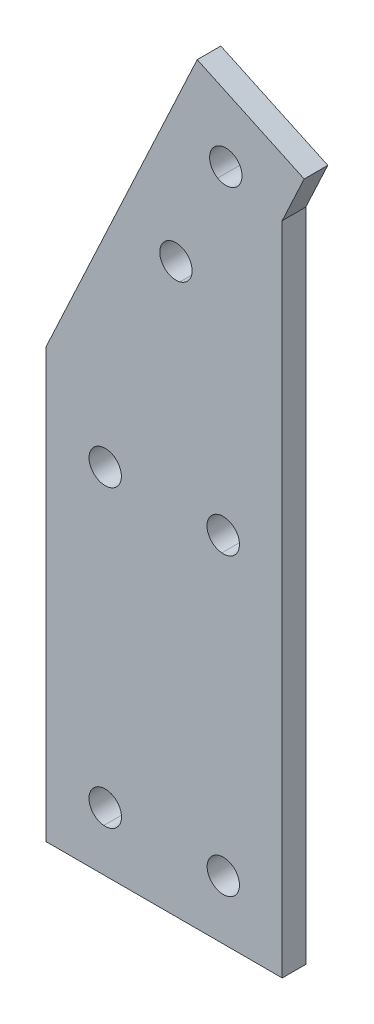
ISO-10303-21;
HEADER;
FILE_DESCRIPTION(('STEP AP214'),'2;1');
FILE_NAME('part.step','',(''),(''),'','','');
FILE_SCHEMA(('AUTOMOTIVE_DESIGN { 1 0 10303 214 1 1 1 1 }'));
ENDSEC;
DATA;
#1=APPLICATION_CONTEXT('core data for automotive mechanical design processes');
#2=APPLICATION_PROTOCOL_DEFINITION('international standard','automotive_design',2000,#1);
#3=PRODUCT_CONTEXT('',#1,'mechanical');
#4=PRODUCT('Part','Part','',(#3));
#5=PRODUCT_RELATED_PRODUCT_CATEGORY('part','',(#4));
#6=PRODUCT_DEFINITION_FORMATION('','',#4);
#7=PRODUCT_DEFINITION_CONTEXT('part definition',#1,'design');
#8=PRODUCT_DEFINITION('design','',#6,#7);
#9=PRODUCT_DEFINITION_SHAPE('','',#8);
#10=(LENGTH_UNIT() NAMED_UNIT(*) SI_UNIT(.MILLI.,.METRE.));
#11=(NAMED_UNIT(*) PLANE_ANGLE_UNIT() SI_UNIT($,.RADIAN.));
#12=(NAMED_UNIT(*) SI_UNIT($,.STERADIAN.) SOLID_ANGLE_UNIT());
#13=UNCERTAINTY_MEASURE_WITH_UNIT(LENGTH_MEASURE(1.E-05),#10,'distance_accuracy_value','');
#14=(GEOMETRIC_REPRESENTATION_CONTEXT(3) GLOBAL_UNCERTAINTY_ASSIGNED_CONTEXT((#13)) GLOBAL_UNIT_ASSIGNED_CONTEXT((#10,
#11,#12)) REPRESENTATION_CONTEXT('',''));
#15=CARTESIAN_POINT('',(0.,0.,0.));
#16=DIRECTION('',(0.,0.,1.));
#17=DIRECTION('',(1.,0.,0.));
#18=AXIS2_PLACEMENT_3D('',#15,#16,#17);
#19=CARTESIAN_POINT('',(-252.534787145301,-541.560382611528,4.));
#20=DIRECTION('',(-0.422619682236342,-0.906307124647298,0.));
#21=DIRECTION('',(0.906307124647298,-0.422619682236342,0.));
#22=AXIS2_PLACEMENT_3D('',#19,#20,#21);
#23=PLANE('',#22);
#24=DIRECTION('',(-0.906307124647298,0.422619682236342,0.));
#25=VECTOR('',#24,1.);
#26=CARTESIAN_POINT('',(-252.534787145301,-541.560382611528,0.));
#27=LINE('',#26,#25);
#28=CARTESIAN_POINT('',(-243.202124871513,-545.912292308919,0.));
#29=VERTEX_POINT('',#28);
#30=CARTESIAN_POINT('',(-261.328002929688,-537.460021972656,0.));
#31=VERTEX_POINT('',#30);
#32=EDGE_CURVE('E201',#29,#31,#27,.T.);
#33=ORIENTED_EDGE('',*,*,#32,.T.);
#34=DIRECTION('',(0.,0.,-1.));
#35=VECTOR('',#34,1.);
#36=CARTESIAN_POINT('',(-261.328002929688,-537.460021972656,4.));
#37=LINE('',#36,#35);
#38=CARTESIAN_POINT('',(-261.328002929688,-537.460021972656,4.));
#39=VERTEX_POINT('',#38);
#40=EDGE_CURVE('E11',#39,#31,#37,.T.);
#41=ORIENTED_EDGE('',*,*,#40,.F.);
#42=DIRECTION('',(-0.906307124647298,0.422619682236342,0.));
#43=VECTOR('',#42,1.);
#44=CARTESIAN_POINT('',(-252.534787145301,-541.560382611528,4.));
#45=LINE('',#44,#43);
#46=CARTESIAN_POINT('',(-243.202124871513,-545.912292308919,4.));
#47=VERTEX_POINT('',#46);
#48=EDGE_CURVE('E318',#47,#39,#45,.T.);
#49=ORIENTED_EDGE('',*,*,#48,.F.);
#50=DIRECTION('',(0.,0.,-1.));
#51=VECTOR('',#50,1.);
#52=CARTESIAN_POINT('',(-243.202124871513,-545.912292308919,4.));
#53=LINE('',#52,#51);
#54=EDGE_CURVE('E212',#47,#29,#53,.T.);
#55=ORIENTED_EDGE('',*,*,#54,.T.);
#56=EDGE_LOOP('',(#33,#41,#49,#55));
#57=FACE_BOUND('',#56,.T.);
#58=ADVANCED_FACE('F35',(#57),#23,.F.);
#59=CARTESIAN_POINT('',(-8.79321578438574,4.10036063887162,4.));
#60=DIRECTION('',(0.906307124647298,-0.422619682236342,0.));
#61=DIRECTION('',(0.422619682236342,0.906307124647298,0.));
#62=AXIS2_PLACEMENT_3D('',#59,#60,#61);
#63=PLANE('',#62);
#64=DIRECTION('',(-0.422619682236342,-0.906307124647298,0.));
#65=VECTOR('',#64,1.);
#66=CARTESIAN_POINT('',(-8.79321578438574,4.10036063887162,0.));
#67=LINE('',#66,#65);
#68=CARTESIAN_POINT('',(-286.920013427734,-592.342041015625,0.));
#69=VERTEX_POINT('',#68);
#70=EDGE_CURVE('E204',#31,#69,#67,.T.);
#71=ORIENTED_EDGE('',*,*,#70,.T.);
#72=DIRECTION('',(0.,0.,-1.));
#73=VECTOR('',#72,1.);
#74=CARTESIAN_POINT('',(-286.920013427734,-592.342041015625,4.));
#75=LINE('',#74,#73);
#76=CARTESIAN_POINT('',(-286.920013427734,-592.342041015625,4.));
#77=VERTEX_POINT('',#76);
#78=EDGE_CURVE('E45',#77,#69,#75,.T.);
#79=ORIENTED_EDGE('',*,*,#78,.F.);
#80=DIRECTION('',(-0.422619682236342,-0.906307124647298,0.));
#81=VECTOR('',#80,1.);
#82=CARTESIAN_POINT('',(-8.79321578438574,4.10036063887162,4.));
#83=LINE('',#82,#81);
#84=EDGE_CURVE('E319',#39,#77,#83,.T.);
#85=ORIENTED_EDGE('',*,*,#84,.F.);
#86=ORIENTED_EDGE('',*,*,#40,.T.);
#87=EDGE_LOOP('',(#71,#79,#85,#86));
#88=FACE_BOUND('',#87,.T.);
#89=ADVANCED_FACE('F254',(#88),#63,.F.);
#90=CARTESIAN_POINT('',(-286.920013427734,0.,4.));
#91=DIRECTION('',(1.,0.,0.));
#92=DIRECTION('',(0.,0.,-1.));
#93=AXIS2_PLACEMENT_3D('',#90,#91,#92);
#94=PLANE('',#93);
#95=DIRECTION('',(0.,-1.,0.));
#96=VECTOR('',#95,1.);
#97=CARTESIAN_POINT('',(-286.920013427734,0.,0.));
#98=LINE('',#97,#96);
#99=CARTESIAN_POINT('',(-286.920013427734,-665.044006347656,0.));
#100=VERTEX_POINT('',#99);
#101=EDGE_CURVE('E206',#69,#100,#98,.T.);
#102=ORIENTED_EDGE('',*,*,#101,.T.);
#103=DIRECTION('',(0.,0.,-1.));
#104=VECTOR('',#103,1.);
#105=CARTESIAN_POINT('',(-286.920013427734,-665.044006347656,4.));
#106=LINE('',#105,#104);
#107=CARTESIAN_POINT('',(-286.920013427734,-665.044006347656,4.));
#108=VERTEX_POINT('',#107);
#109=EDGE_CURVE('E162',#108,#100,#106,.T.);
#110=ORIENTED_EDGE('',*,*,#109,.F.);
#111=DIRECTION('',(0.,-1.,0.));
#112=VECTOR('',#111,1.);
#113=CARTESIAN_POINT('',(-286.920013427734,0.,4.));
#114=LINE('',#113,#112);
#115=EDGE_CURVE('E153',#77,#108,#114,.T.);
#116=ORIENTED_EDGE('',*,*,#115,.F.);
#117=ORIENTED_EDGE('',*,*,#78,.T.);
#118=EDGE_LOOP('',(#102,#110,#116,#117));
#119=FACE_BOUND('',#118,.T.);
#120=ADVANCED_FACE('F260',(#119),#94,.F.);
#121=CARTESIAN_POINT('',(0.,-665.044006347656,4.));
#122=DIRECTION('',(0.,1.,0.));
#123=DIRECTION('',(0.,0.,1.));
#124=AXIS2_PLACEMENT_3D('',#121,#122,#123);
#125=PLANE('',#124);
#126=DIRECTION('',(1.,0.,0.));
#127=VECTOR('',#126,1.);
#128=CARTESIAN_POINT('',(0.,-665.044006347656,0.));
#129=LINE('',#128,#127);
#130=CARTESIAN_POINT('',(-246.920414440026,-665.044006347656,0.));
#131=VERTEX_POINT('',#130);
#132=EDGE_CURVE('E161',#100,#131,#129,.T.);
#133=ORIENTED_EDGE('',*,*,#132,.T.);
#134=DIRECTION('',(0.,0.,-1.));
#135=VECTOR('',#134,1.);
#136=CARTESIAN_POINT('',(-246.920414440026,-665.044006347656,4.));
#137=LINE('',#136,#135);
#138=CARTESIAN_POINT('',(-246.920414440026,-665.044006347656,4.));
#139=VERTEX_POINT('',#138);
#140=EDGE_CURVE('E158',#139,#131,#137,.T.);
#141=ORIENTED_EDGE('',*,*,#140,.F.);
#142=DIRECTION('',(1.,0.,0.));
#143=VECTOR('',#142,1.);
#144=CARTESIAN_POINT('',(0.,-665.044006347656,4.));
#145=LINE('',#144,#143);
#146=EDGE_CURVE('E147',#108,#139,#145,.T.);
#147=ORIENTED_EDGE('',*,*,#146,.F.);
#148=ORIENTED_EDGE('',*,*,#109,.T.);
#149=EDGE_LOOP('',(#133,#141,#147,#148));
#150=FACE_BOUND('',#149,.T.);
#151=ADVANCED_FACE('F159',(#150),#125,.F.);
#152=CARTESIAN_POINT('',(-246.920414440026,1.23309659163033E-13,4.));
#153=DIRECTION('',(-1.,0.,0.));
#154=DIRECTION('',(0.,-1.,0.));
#155=AXIS2_PLACEMENT_3D('',#152,#153,#154);
#156=PLANE('',#155);
#157=DIRECTION('',(0.,1.,0.));
#158=VECTOR('',#157,1.);
#159=CARTESIAN_POINT('',(-246.920414440026,1.23309659163033E-13,0.));
#160=LINE('',#159,#158);
#161=CARTESIAN_POINT('',(-246.920414440026,-553.886157391617,0.));
#162=VERTEX_POINT('',#161);
#163=EDGE_CURVE('E101',#131,#162,#160,.T.);
#164=ORIENTED_EDGE('',*,*,#163,.T.);
#165=DIRECTION('',(0.,0.,-1.));
#166=VECTOR('',#165,1.);
#167=CARTESIAN_POINT('',(-246.920414440026,-553.886157391617,4.));
#168=LINE('',#167,#166);
#169=CARTESIAN_POINT('',(-246.920414440026,-553.886157391617,4.));
#170=VERTEX_POINT('',#169);
#171=EDGE_CURVE('E163',#170,#162,#168,.T.);
#172=ORIENTED_EDGE('',*,*,#171,.F.);
#173=DIRECTION('',(0.,1.,0.));
#174=VECTOR('',#173,1.);
#175=CARTESIAN_POINT('',(-246.920414440026,1.23309659163033E-13,4.));
#176=LINE('',#175,#174);
#177=EDGE_CURVE('E151',#139,#170,#176,.T.);
#178=ORIENTED_EDGE('',*,*,#177,.F.);
#179=ORIENTED_EDGE('',*,*,#140,.T.);
#180=EDGE_LOOP('',(#164,#172,#178,#179));
#181=FACE_BOUND('',#180,.T.);
#182=ADVANCED_FACE('F165',(#181),#156,.F.);
#183=CARTESIAN_POINT('',(-256.480801046647,-550.748112360418,4.));
#184=DIRECTION('',(0.,0.,-1.));
#185=DIRECTION('',(-1.,0.,0.));
#186=AXIS2_PLACEMENT_3D('',#183,#184,#185);
#187=CYLINDRICAL_SURFACE('',#186,2.74594004548301);
#188=CARTESIAN_POINT('',(-256.480801046647,-550.748112360418,0.));
#189=DIRECTION('',(0.,0.,1.));
#190=DIRECTION('',(1.,0.,0.));
#191=AXIS2_PLACEMENT_3D('',#188,#189,#190);
#192=CIRCLE('',#191,2.74594004548301);
#193=CARTESIAN_POINT('',(-254.228012084971,-549.178039550788,0.));
#194=VERTEX_POINT('',#193);
#195=CARTESIAN_POINT('',(-257.878021240939,-553.111999511288,0.));
#196=VERTEX_POINT('',#195);
#197=EDGE_CURVE('E195',#194,#196,#192,.T.);
#198=ORIENTED_EDGE('',*,*,#197,.F.);
#199=DIRECTION('',(0.,0.,-1.));
#200=VECTOR('',#199,1.);
#201=CARTESIAN_POINT('',(-254.228012084971,-549.178039550788,4.));
#202=LINE('',#201,#200);
#203=CARTESIAN_POINT('',(-254.228012084971,-549.178039550788,4.));
#204=VERTEX_POINT('',#203);
#205=EDGE_CURVE('E214',#204,#194,#202,.T.);
#206=ORIENTED_EDGE('',*,*,#205,.F.);
#207=CARTESIAN_POINT('',(-256.480801046647,-550.748112360418,4.));
#208=DIRECTION('',(0.,0.,1.));
#209=DIRECTION('',(1.,0.,0.));
#210=AXIS2_PLACEMENT_3D('',#207,#208,#209);
#211=CIRCLE('',#210,2.74594004548301);
#212=CARTESIAN_POINT('',(-257.878021240939,-553.111999511288,4.));
#213=VERTEX_POINT('',#212);
#214=EDGE_CURVE('E323',#204,#213,#211,.T.);
#215=ORIENTED_EDGE('',*,*,#214,.T.);
#216=DIRECTION('',(0.,0.,-1.));
#217=VECTOR('',#216,1.);
#218=CARTESIAN_POINT('',(-257.878021240939,-553.111999511288,4.));
#219=LINE('',#218,#217);
#220=EDGE_CURVE('E219',#213,#196,#219,.T.);
#221=ORIENTED_EDGE('',*,*,#220,.T.);
#222=EDGE_LOOP('',(#198,#206,#215,#221));
#223=FACE_BOUND('',#222,.T.);
#224=ADVANCED_FACE('F265',(#223),#187,.F.);
#225=CARTESIAN_POINT('',(-264.926460072738,-568.87944828433,4.));
#226=DIRECTION('',(0.,0.,-1.));
#227=DIRECTION('',(-1.,0.,0.));
#228=AXIS2_PLACEMENT_3D('',#225,#226,#227);
#229=CYLINDRICAL_SURFACE('',#228,2.7485899952222);
#230=CARTESIAN_POINT('',(-264.926460072738,-568.87944828433,0.));
#231=DIRECTION('',(0.,0.,1.));
#232=DIRECTION('',(1.,0.,0.));
#233=AXIS2_PLACEMENT_3D('',#230,#231,#232);
#234=CIRCLE('',#233,2.7485899952222);
#235=CARTESIAN_POINT('',(-265.174011230489,-566.142028808595,0.));
#236=VERTEX_POINT('',#235);
#237=CARTESIAN_POINT('',(-264.252014160156,-571.544006347656,0.));
#238=VERTEX_POINT('',#237);
#239=EDGE_CURVE('E189',#236,#238,#234,.T.);
#240=ORIENTED_EDGE('',*,*,#239,.F.);
#241=DIRECTION('',(0.,0.,-1.));
#242=VECTOR('',#241,1.);
#243=CARTESIAN_POINT('',(-265.174011230489,-566.142028808595,4.));
#244=LINE('',#243,#242);
#245=CARTESIAN_POINT('',(-265.174011230489,-566.142028808595,4.));
#246=VERTEX_POINT('',#245);
#247=EDGE_CURVE('E221',#246,#236,#244,.T.);
#248=ORIENTED_EDGE('',*,*,#247,.F.);
#249=CARTESIAN_POINT('',(-264.926460072738,-568.87944828433,4.));
#250=DIRECTION('',(0.,0.,1.));
#251=DIRECTION('',(1.,0.,0.));
#252=AXIS2_PLACEMENT_3D('',#249,#250,#251);
#253=CIRCLE('',#252,2.7485899952222);
#254=CARTESIAN_POINT('',(-264.252014160156,-571.544006347656,4.));
#255=VERTEX_POINT('',#254);
#256=EDGE_CURVE('E330',#246,#255,#253,.T.);
#257=ORIENTED_EDGE('',*,*,#256,.T.);
#258=DIRECTION('',(0.,0.,-1.));
#259=VECTOR('',#258,1.);
#260=CARTESIAN_POINT('',(-264.252014160156,-571.544006347656,4.));
#261=LINE('',#260,#259);
#262=EDGE_CURVE('E223',#255,#238,#261,.T.);
#263=ORIENTED_EDGE('',*,*,#262,.T.);
#264=EDGE_LOOP('',(#240,#248,#257,#263));
#265=FACE_BOUND('',#264,.T.);
#266=ADVANCED_FACE('F249',(#265),#229,.F.);
#267=CARTESIAN_POINT('',(-256.933918123505,-605.042834480954,4.));
#268=DIRECTION('',(0.,0.,-1.));
#269=DIRECTION('',(-1.,0.,0.));
#270=AXIS2_PLACEMENT_3D('',#267,#268,#269);
#271=CYLINDRICAL_SURFACE('',#270,2.73943916391455);
#272=CARTESIAN_POINT('',(-256.933918123505,-605.042834480954,0.));
#273=DIRECTION('',(0.,0.,1.));
#274=DIRECTION('',(1.,0.,0.));
#275=AXIS2_PLACEMENT_3D('',#272,#273,#274);
#276=CIRCLE('',#275,2.73943916391455);
#277=CARTESIAN_POINT('',(-256.682006835938,-602.315002441406,0.));
#278=VERTEX_POINT('',#277);
#279=CARTESIAN_POINT('',(-257.15901184082,-607.773010253906,0.));
#280=VERTEX_POINT('',#279);
#281=EDGE_CURVE('E183',#278,#280,#276,.T.);
#282=ORIENTED_EDGE('',*,*,#281,.F.);
#283=DIRECTION('',(0.,0.,-1.));
#284=VECTOR('',#283,1.);
#285=CARTESIAN_POINT('',(-256.682006835938,-602.315002441406,4.));
#286=LINE('',#285,#284);
#287=CARTESIAN_POINT('',(-256.682006835938,-602.315002441406,4.));
#288=VERTEX_POINT('',#287);
#289=EDGE_CURVE('E225',#288,#278,#286,.T.);
#290=ORIENTED_EDGE('',*,*,#289,.F.);
#291=CARTESIAN_POINT('',(-256.933918123505,-605.042834480954,4.));
#292=DIRECTION('',(0.,0.,1.));
#293=DIRECTION('',(1.,0.,0.));
#294=AXIS2_PLACEMENT_3D('',#291,#292,#293);
#295=CIRCLE('',#294,2.73943916391455);
#296=CARTESIAN_POINT('',(-257.15901184082,-607.773010253906,4.));
#297=VERTEX_POINT('',#296);
#298=EDGE_CURVE('E335',#288,#297,#295,.T.);
#299=ORIENTED_EDGE('',*,*,#298,.T.);
#300=DIRECTION('',(0.,0.,-1.));
#301=VECTOR('',#300,1.);
#302=CARTESIAN_POINT('',(-257.15901184082,-607.773010253906,4.));
#303=LINE('',#302,#301);
#304=EDGE_CURVE('E227',#297,#280,#303,.T.);
#305=ORIENTED_EDGE('',*,*,#304,.T.);
#306=EDGE_LOOP('',(#282,#290,#299,#305));
#307=FACE_BOUND('',#306,.T.);
#308=ADVANCED_FACE('F241',(#307),#271,.F.);
#309=CARTESIAN_POINT('',(-276.931018001974,-655.038240921052,4.));
#310=DIRECTION('',(0.,0.,-1.));
#311=DIRECTION('',(-1.,0.,0.));
#312=AXIS2_PLACEMENT_3D('',#309,#310,#311);
#313=CYLINDRICAL_SURFACE('',#312,2.74425663786638);
#314=CARTESIAN_POINT('',(-276.931018001974,-655.038240921052,0.));
#315=DIRECTION('',(0.,0.,1.));
#316=DIRECTION('',(1.,0.,0.));
#317=AXIS2_PLACEMENT_3D('',#314,#315,#316);
#318=CIRCLE('',#317,2.74425663786638);
#319=CARTESIAN_POINT('',(-276.920013427734,-652.294006347656,0.));
#320=VERTEX_POINT('',#319);
#321=CARTESIAN_POINT('',(-277.15901184084,-657.773010253905,0.));
#322=VERTEX_POINT('',#321);
#323=EDGE_CURVE('E174',#320,#322,#318,.T.);
#324=ORIENTED_EDGE('',*,*,#323,.F.);
#325=DIRECTION('',(0.,0.,-1.));
#326=VECTOR('',#325,1.);
#327=CARTESIAN_POINT('',(-276.920013427734,-652.294006347656,4.));
#328=LINE('',#327,#326);
#329=CARTESIAN_POINT('',(-276.920013427734,-652.294006347656,4.));
#330=VERTEX_POINT('',#329);
#331=EDGE_CURVE('E39',#330,#320,#328,.T.);
#332=ORIENTED_EDGE('',*,*,#331,.F.);
#333=CARTESIAN_POINT('',(-276.931018001974,-655.038240921052,4.));
#334=DIRECTION('',(0.,0.,1.));
#335=DIRECTION('',(1.,0.,0.));
#336=AXIS2_PLACEMENT_3D('',#333,#334,#335);
#337=CIRCLE('',#336,2.74425663786638);
#338=CARTESIAN_POINT('',(-277.15901184084,-657.773010253905,4.));
#339=VERTEX_POINT('',#338);
#340=EDGE_CURVE('E342',#330,#339,#337,.T.);
#341=ORIENTED_EDGE('',*,*,#340,.T.);
#342=DIRECTION('',(0.,0.,-1.));
#343=VECTOR('',#342,1.);
#344=CARTESIAN_POINT('',(-277.15901184084,-657.773010253905,4.));
#345=LINE('',#344,#343);
#346=EDGE_CURVE('E167',#339,#322,#345,.T.);
#347=ORIENTED_EDGE('',*,*,#346,.T.);
#348=EDGE_LOOP('',(#324,#332,#341,#347));
#349=FACE_BOUND('',#348,.T.);
#350=ADVANCED_FACE('F238',(#349),#313,.F.);
#351=CARTESIAN_POINT('',(-256.480014400969,-550.748842226496,4.));
#352=DIRECTION('',(0.,0.,-1.));
#353=DIRECTION('',(-1.,0.,0.));
#354=AXIS2_PLACEMENT_3D('',#351,#352,#353);
#355=CYLINDRICAL_SURFACE('',#354,2.74571219855064);
#356=CARTESIAN_POINT('',(-256.480014400969,-550.748842226496,0.));
#357=DIRECTION('',(0.,0.,1.));
#358=DIRECTION('',(1.,0.,0.));
#359=AXIS2_PLACEMENT_3D('',#356,#357,#358);
#360=CIRCLE('',#359,2.74571219855064);
#361=EDGE_CURVE('E198',#194,#196,#360,.F.);
#362=ORIENTED_EDGE('',*,*,#361,.T.);
#363=ORIENTED_EDGE('',*,*,#220,.F.);
#364=CARTESIAN_POINT('',(-256.480014400969,-550.748842226496,4.));
#365=DIRECTION('',(0.,0.,1.));
#366=DIRECTION('',(1.,0.,0.));
#367=AXIS2_PLACEMENT_3D('',#364,#365,#366);
#368=CIRCLE('',#367,2.74571219855064);
#369=EDGE_CURVE('E320',#204,#213,#368,.F.);
#370=ORIENTED_EDGE('',*,*,#369,.F.);
#371=ORIENTED_EDGE('',*,*,#205,.T.);
#372=EDGE_LOOP('',(#362,#363,#370,#371));
#373=FACE_BOUND('',#372,.T.);
#374=ADVANCED_FACE('F240',(#373),#355,.F.);
#375=CARTESIAN_POINT('',(-264.946889162808,-568.882935074317,4.));
#376=DIRECTION('',(0.,0.,-1.));
#377=DIRECTION('',(-1.,0.,0.));
#378=AXIS2_PLACEMENT_3D('',#375,#376,#377);
#379=CYLINDRICAL_SURFACE('',#378,2.75030027289771);
#380=CARTESIAN_POINT('',(-264.946889162808,-568.882935074317,0.));
#381=DIRECTION('',(0.,0.,1.));
#382=DIRECTION('',(1.,0.,0.));
#383=AXIS2_PLACEMENT_3D('',#380,#381,#382);
#384=CIRCLE('',#383,2.75030027289771);
#385=EDGE_CURVE('E192',#236,#238,#384,.F.);
#386=ORIENTED_EDGE('',*,*,#385,.T.);
#387=ORIENTED_EDGE('',*,*,#262,.F.);
#388=CARTESIAN_POINT('',(-264.946889162808,-568.882935074317,4.));
#389=DIRECTION('',(0.,0.,1.));
#390=DIRECTION('',(1.,0.,0.));
#391=AXIS2_PLACEMENT_3D('',#388,#389,#390);
#392=CIRCLE('',#391,2.75030027289771);
#393=EDGE_CURVE('E328',#246,#255,#392,.F.);
#394=ORIENTED_EDGE('',*,*,#393,.F.);
#395=ORIENTED_EDGE('',*,*,#247,.T.);
#396=EDGE_LOOP('',(#386,#387,#394,#395));
#397=FACE_BOUND('',#396,.T.);
#398=ADVANCED_FACE('F246',(#397),#379,.F.);
#399=CARTESIAN_POINT('',(-256.909572857211,-605.044962146261,4.));
#400=DIRECTION('',(0.,0.,-1.));
#401=DIRECTION('',(-1.,0.,0.));
#402=AXIS2_PLACEMENT_3D('',#399,#400,#401);
#403=CYLINDRICAL_SURFACE('',#402,2.73942809436021);
#404=CARTESIAN_POINT('',(-256.909572857211,-605.044962146261,0.));
#405=DIRECTION('',(0.,0.,1.));
#406=DIRECTION('',(1.,0.,0.));
#407=AXIS2_PLACEMENT_3D('',#404,#405,#406);
#408=CIRCLE('',#407,2.73942809436021);
#409=EDGE_CURVE('E186',#278,#280,#408,.F.);
#410=ORIENTED_EDGE('',*,*,#409,.T.);
#411=ORIENTED_EDGE('',*,*,#304,.F.);
#412=CARTESIAN_POINT('',(-256.909572857211,-605.044962146261,4.));
#413=DIRECTION('',(0.,0.,1.));
#414=DIRECTION('',(1.,0.,0.));
#415=AXIS2_PLACEMENT_3D('',#412,#413,#414);
#416=CIRCLE('',#415,2.73942809436021);
#417=EDGE_CURVE('E333',#288,#297,#416,.F.);
#418=ORIENTED_EDGE('',*,*,#417,.F.);
#419=ORIENTED_EDGE('',*,*,#289,.T.);
#420=EDGE_LOOP('',(#410,#411,#418,#419));
#421=FACE_BOUND('',#420,.T.);
#422=ADVANCED_FACE('F271',(#421),#403,.F.);
#423=CARTESIAN_POINT('',(-276.923368100296,-605.045435286243,4.));
#424=DIRECTION('',(0.,0.,-1.));
#425=DIRECTION('',(-1.,0.,0.));
#426=AXIS2_PLACEMENT_3D('',#423,#424,#425);
#427=CYLINDRICAL_SURFACE('',#426,2.74284189578025);
#428=CARTESIAN_POINT('',(-276.923368100296,-605.045435286243,4.));
#429=DIRECTION('',(0.,0.,1.));
#430=DIRECTION('',(1.,0.,0.));
#431=AXIS2_PLACEMENT_3D('',#428,#429,#430);
#432=CIRCLE('',#431,2.74284189578025);
#433=CARTESIAN_POINT('',(-274.180526204515,-605.045435286243,4.));
#434=VERTEX_POINT('',#433);
#435=EDGE_CURVE('E338',#434,#434,#432,.T.);
#436=ORIENTED_EDGE('',*,*,#435,.T.);
#437=EDGE_LOOP('',(#436));
#438=FACE_BOUND('',#437,.T.);
#439=CARTESIAN_POINT('',(-276.923368100296,-605.045435286243,0.));
#440=DIRECTION('',(0.,0.,1.));
#441=DIRECTION('',(1.,0.,0.));
#442=AXIS2_PLACEMENT_3D('',#439,#440,#441);
#443=CIRCLE('',#442,2.74284189578025);
#444=CARTESIAN_POINT('',(-274.180526204515,-605.045435286243,0.));
#445=VERTEX_POINT('',#444);
#446=EDGE_CURVE('E180',#445,#445,#443,.T.);
#447=ORIENTED_EDGE('',*,*,#446,.F.);
#448=EDGE_LOOP('',(#447));
#449=FACE_BOUND('',#448,.T.);
#450=ADVANCED_FACE('F277',(#438,#449),#427,.F.);
#451=CARTESIAN_POINT('',(-276.914144451728,-655.038976958441,4.));
#452=DIRECTION('',(0.,0.,-1.));
#453=DIRECTION('',(-1.,0.,0.));
#454=AXIS2_PLACEMENT_3D('',#451,#452,#453);
#455=CYLINDRICAL_SURFACE('',#454,2.74497688495785);
#456=CARTESIAN_POINT('',(-276.914144451728,-655.038976958441,0.));
#457=DIRECTION('',(0.,0.,1.));
#458=DIRECTION('',(1.,0.,0.));
#459=AXIS2_PLACEMENT_3D('',#456,#457,#458);
#460=CIRCLE('',#459,2.74497688495785);
#461=EDGE_CURVE('E177',#320,#322,#460,.F.);
#462=ORIENTED_EDGE('',*,*,#461,.T.);
#463=ORIENTED_EDGE('',*,*,#346,.F.);
#464=CARTESIAN_POINT('',(-276.914144451728,-655.038976958441,4.));
#465=DIRECTION('',(0.,0.,1.));
#466=DIRECTION('',(1.,0.,0.));
#467=AXIS2_PLACEMENT_3D('',#464,#465,#466);
#468=CIRCLE('',#467,2.74497688495785);
#469=EDGE_CURVE('E233',#330,#339,#468,.F.);
#470=ORIENTED_EDGE('',*,*,#469,.F.);
#471=ORIENTED_EDGE('',*,*,#331,.T.);
#472=EDGE_LOOP('',(#462,#463,#470,#471));
#473=FACE_BOUND('',#472,.T.);
#474=ADVANCED_FACE('F232',(#473),#455,.F.);
#475=CARTESIAN_POINT('',(-256.909572857211,-655.044981368028,4.));
#476=DIRECTION('',(0.,0.,-1.));
#477=DIRECTION('',(-1.,0.,0.));
#478=AXIS2_PLACEMENT_3D('',#475,#476,#477);
#479=CYLINDRICAL_SURFACE('',#478,2.73940895244438);
#480=CARTESIAN_POINT('',(-256.909572857211,-655.044981368028,4.));
#481=DIRECTION('',(0.,0.,1.));
#482=DIRECTION('',(1.,0.,0.));
#483=AXIS2_PLACEMENT_3D('',#480,#481,#482);
#484=CIRCLE('',#483,2.73940895244438);
#485=CARTESIAN_POINT('',(-254.170163904766,-655.044981368028,4.));
#486=VERTEX_POINT('',#485);
#487=EDGE_CURVE('E211',#486,#486,#484,.T.);
#488=ORIENTED_EDGE('',*,*,#487,.T.);
#489=EDGE_LOOP('',(#488));
#490=FACE_BOUND('',#489,.T.);
#491=CARTESIAN_POINT('',(-256.909572857211,-655.044981368028,0.));
#492=DIRECTION('',(0.,0.,1.));
#493=DIRECTION('',(1.,0.,0.));
#494=AXIS2_PLACEMENT_3D('',#491,#492,#493);
#495=CIRCLE('',#494,2.73940895244438);
#496=CARTESIAN_POINT('',(-254.170163904766,-655.044981368028,0.));
#497=VERTEX_POINT('',#496);
#498=EDGE_CURVE('E171',#497,#497,#495,.T.);
#499=ORIENTED_EDGE('',*,*,#498,.F.);
#500=EDGE_LOOP('',(#499));
#501=FACE_BOUND('',#500,.T.);
#502=ADVANCED_FACE('F37',(#490,#501),#479,.F.);
#503=CARTESIAN_POINT('',(9.33266227378827,-4.35190969739141,4.));
#504=DIRECTION('',(-0.906307124647298,0.422619682236342,0.));
#505=DIRECTION('',(-0.422619682236342,-0.906307124647298,0.));
#506=AXIS2_PLACEMENT_3D('',#503,#504,#505);
#507=PLANE('',#506);
#508=DIRECTION('',(0.422619682236342,0.906307124647298,0.));
#509=VECTOR('',#508,1.);
#510=CARTESIAN_POINT('',(9.33266227378827,-4.35190969739141,0.));
#511=LINE('',#510,#509);
#512=EDGE_CURVE('E107',#162,#29,#511,.T.);
#513=ORIENTED_EDGE('',*,*,#512,.T.);
#514=ORIENTED_EDGE('',*,*,#54,.F.);
#515=DIRECTION('',(0.422619682236342,0.906307124647298,0.));
#516=VECTOR('',#515,1.);
#517=CARTESIAN_POINT('',(9.33266227378827,-4.35190969739141,4.));
#518=LINE('',#517,#516);
#519=EDGE_CURVE('E54',#170,#47,#518,.T.);
#520=ORIENTED_EDGE('',*,*,#519,.F.);
#521=ORIENTED_EDGE('',*,*,#171,.T.);
#522=EDGE_LOOP('',(#513,#514,#520,#521));
#523=FACE_BOUND('',#522,.T.);
#524=ADVANCED_FACE('F286',(#523),#507,.F.);
#525=CARTESIAN_POINT('',(0.,0.,4.));
#526=DIRECTION('',(0.,0.,1.));
#527=DIRECTION('',(1.,0.,0.));
#528=AXIS2_PLACEMENT_3D('',#525,#526,#527);
#529=PLANE('',#528);
#530=ORIENTED_EDGE('',*,*,#487,.F.);
#531=EDGE_LOOP('',(#530));
#532=FACE_BOUND('',#531,.T.);
#533=ORIENTED_EDGE('',*,*,#340,.F.);
#534=ORIENTED_EDGE('',*,*,#469,.T.);
#535=EDGE_LOOP('',(#533,#534));
#536=FACE_BOUND('',#535,.T.);
#537=ORIENTED_EDGE('',*,*,#435,.F.);
#538=EDGE_LOOP('',(#537));
#539=FACE_BOUND('',#538,.T.);
#540=ORIENTED_EDGE('',*,*,#298,.F.);
#541=ORIENTED_EDGE('',*,*,#417,.T.);
#542=EDGE_LOOP('',(#540,#541));
#543=FACE_BOUND('',#542,.T.);
#544=ORIENTED_EDGE('',*,*,#256,.F.);
#545=ORIENTED_EDGE('',*,*,#393,.T.);
#546=EDGE_LOOP('',(#544,#545));
#547=FACE_BOUND('',#546,.T.);
#548=ORIENTED_EDGE('',*,*,#214,.F.);
#549=ORIENTED_EDGE('',*,*,#369,.T.);
#550=EDGE_LOOP('',(#548,#549));
#551=FACE_BOUND('',#550,.T.);
#552=ORIENTED_EDGE('',*,*,#48,.T.);
#553=ORIENTED_EDGE('',*,*,#84,.T.);
#554=ORIENTED_EDGE('',*,*,#115,.T.);
#555=ORIENTED_EDGE('',*,*,#146,.T.);
#556=ORIENTED_EDGE('',*,*,#177,.T.);
#557=ORIENTED_EDGE('',*,*,#519,.T.);
#558=EDGE_LOOP('',(#552,#553,#554,#555,#556,#557));
#559=FACE_BOUND('',#558,.T.);
#560=ADVANCED_FACE('F149',(#532,#536,#539,#543,#547,#551,#559),#529,.T.);
#561=CARTESIAN_POINT('',(0.,0.,0.));
#562=DIRECTION('',(0.,0.,1.));
#563=DIRECTION('',(1.,0.,0.));
#564=AXIS2_PLACEMENT_3D('',#561,#562,#563);
#565=PLANE('',#564);
#566=ORIENTED_EDGE('',*,*,#498,.T.);
#567=EDGE_LOOP('',(#566));
#568=FACE_BOUND('',#567,.T.);
#569=ORIENTED_EDGE('',*,*,#323,.T.);
#570=ORIENTED_EDGE('',*,*,#461,.F.);
#571=EDGE_LOOP('',(#569,#570));
#572=FACE_BOUND('',#571,.T.);
#573=ORIENTED_EDGE('',*,*,#446,.T.);
#574=EDGE_LOOP('',(#573));
#575=FACE_BOUND('',#574,.T.);
#576=ORIENTED_EDGE('',*,*,#281,.T.);
#577=ORIENTED_EDGE('',*,*,#409,.F.);
#578=EDGE_LOOP('',(#576,#577));
#579=FACE_BOUND('',#578,.T.);
#580=ORIENTED_EDGE('',*,*,#239,.T.);
#581=ORIENTED_EDGE('',*,*,#385,.F.);
#582=EDGE_LOOP('',(#580,#581));
#583=FACE_BOUND('',#582,.T.);
#584=ORIENTED_EDGE('',*,*,#197,.T.);
#585=ORIENTED_EDGE('',*,*,#361,.F.);
#586=EDGE_LOOP('',(#584,#585));
#587=FACE_BOUND('',#586,.T.);
#588=ORIENTED_EDGE('',*,*,#32,.F.);
#589=ORIENTED_EDGE('',*,*,#512,.F.);
#590=ORIENTED_EDGE('',*,*,#163,.F.);
#591=ORIENTED_EDGE('',*,*,#132,.F.);
#592=ORIENTED_EDGE('',*,*,#101,.F.);
#593=ORIENTED_EDGE('',*,*,#70,.F.);
#594=EDGE_LOOP('',(#588,#589,#590,#591,#592,#593));
#595=FACE_BOUND('',#594,.T.);
#596=ADVANCED_FACE('F236',(#568,#572,#575,#579,#583,#587,#595),#565,.F.);
#597=CLOSED_SHELL('',(#58,#89,#120,#151,#182,#224,#266,#308,#350,#374,#398,#422,#450,#474,#502,
#524,#560,#596));
#598=MANIFOLD_SOLID_BREP('B2',#597);
#599=ADVANCED_BREP_SHAPE_REPRESENTATION('',(#18,#598),#14);
#600=SHAPE_DEFINITION_REPRESENTATION(#9,#599);
ENDSEC;
END-ISO-10303-21;
